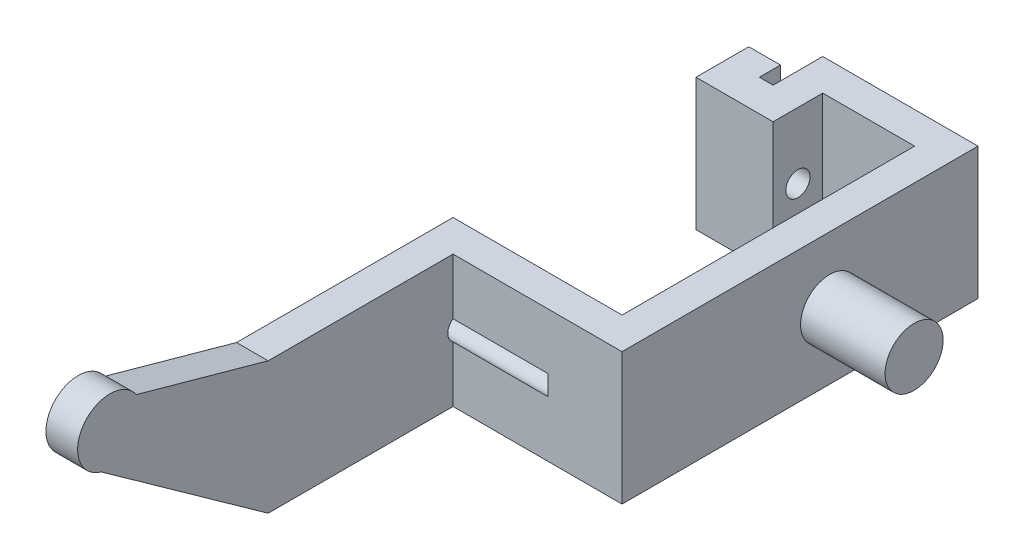
ISO-10303-21;
HEADER;
FILE_DESCRIPTION(('STEP AP214'),'2;1');
FILE_NAME('part.step','',(''),(''),'','','');
FILE_SCHEMA(('AUTOMOTIVE_DESIGN { 1 0 10303 214 1 1 1 1 }'));
ENDSEC;
DATA;
#1=APPLICATION_CONTEXT('core data for automotive mechanical design processes');
#2=APPLICATION_PROTOCOL_DEFINITION('international standard','automotive_design',2000,#1);
#3=PRODUCT_CONTEXT('',#1,'mechanical');
#4=PRODUCT('Part','Part','',(#3));
#5=PRODUCT_RELATED_PRODUCT_CATEGORY('part','',(#4));
#6=PRODUCT_DEFINITION_FORMATION('','',#4);
#7=PRODUCT_DEFINITION_CONTEXT('part definition',#1,'design');
#8=PRODUCT_DEFINITION('design','',#6,#7);
#9=PRODUCT_DEFINITION_SHAPE('','',#8);
#10=(LENGTH_UNIT() NAMED_UNIT(*) SI_UNIT(.MILLI.,.METRE.));
#11=(NAMED_UNIT(*) PLANE_ANGLE_UNIT() SI_UNIT($,.RADIAN.));
#12=(NAMED_UNIT(*) SI_UNIT($,.STERADIAN.) SOLID_ANGLE_UNIT());
#13=UNCERTAINTY_MEASURE_WITH_UNIT(LENGTH_MEASURE(1.E-05),#10,'distance_accuracy_value','');
#14=(GEOMETRIC_REPRESENTATION_CONTEXT(3) GLOBAL_UNCERTAINTY_ASSIGNED_CONTEXT((#13)) GLOBAL_UNIT_ASSIGNED_CONTEXT((#10,
#11,#12)) REPRESENTATION_CONTEXT('',''));
#15=CARTESIAN_POINT('',(0.,0.,0.));
#16=DIRECTION('',(0.,0.,1.));
#17=DIRECTION('',(1.,0.,0.));
#18=AXIS2_PLACEMENT_3D('',#15,#16,#17);
#19=CARTESIAN_POINT('',(0.,0.,0.));
#20=DIRECTION('',(0.,1.,0.));
#21=DIRECTION('',(0.,0.,1.));
#22=AXIS2_PLACEMENT_3D('',#19,#20,#21);
#23=PLANE('',#22);
#24=DIRECTION('',(1.,0.,0.));
#25=VECTOR('',#24,1.);
#26=CARTESIAN_POINT('',(0.,0.,43.5));
#27=LINE('',#26,#25);
#28=CARTESIAN_POINT('',(0.,0.,43.5));
#29=VERTEX_POINT('',#28);
#30=CARTESIAN_POINT('',(3.,0.,43.5));
#31=VERTEX_POINT('',#30);
#32=EDGE_CURVE('E207',#29,#31,#27,.T.);
#33=ORIENTED_EDGE('',*,*,#32,.F.);
#34=DIRECTION('',(0.,0.,1.));
#35=VECTOR('',#34,1.);
#36=CARTESIAN_POINT('',(0.,0.,0.));
#37=LINE('',#36,#35);
#38=CARTESIAN_POINT('',(0.,0.,23.));
#39=VERTEX_POINT('',#38);
#40=EDGE_CURVE('E214',#39,#29,#37,.T.);
#41=ORIENTED_EDGE('',*,*,#40,.F.);
#42=DIRECTION('',(-1.,0.,0.));
#43=VECTOR('',#42,1.);
#44=CARTESIAN_POINT('',(0.,0.,23.));
#45=LINE('',#44,#43);
#46=CARTESIAN_POINT('',(16.,0.,23.));
#47=VERTEX_POINT('',#46);
#48=EDGE_CURVE('E296',#47,#39,#45,.T.);
#49=ORIENTED_EDGE('',*,*,#48,.F.);
#50=DIRECTION('',(0.,0.,-1.));
#51=VECTOR('',#50,1.);
#52=CARTESIAN_POINT('',(16.,0.,0.));
#53=LINE('',#52,#51);
#54=CARTESIAN_POINT('',(16.,0.,-4.7));
#55=VERTEX_POINT('',#54);
#56=EDGE_CURVE('E248',#47,#55,#53,.T.);
#57=ORIENTED_EDGE('',*,*,#56,.T.);
#58=DIRECTION('',(-1.,0.,0.));
#59=VECTOR('',#58,1.);
#60=CARTESIAN_POINT('',(0.,0.,-4.7));
#61=LINE('',#60,#59);
#62=CARTESIAN_POINT('',(7.3,0.,-4.7));
#63=VERTEX_POINT('',#62);
#64=EDGE_CURVE('E253',#55,#63,#61,.T.);
#65=ORIENTED_EDGE('',*,*,#64,.T.);
#66=DIRECTION('',(0.,0.,1.));
#67=VECTOR('',#66,1.);
#68=CARTESIAN_POINT('',(7.3,0.,0.));
#69=LINE('',#68,#67);
#70=CARTESIAN_POINT('',(7.3,0.,0.));
#71=VERTEX_POINT('',#70);
#72=EDGE_CURVE('E329',#63,#71,#69,.T.);
#73=ORIENTED_EDGE('',*,*,#72,.T.);
#74=DIRECTION('',(1.,0.,0.));
#75=VECTOR('',#74,1.);
#76=CARTESIAN_POINT('',(0.,0.,0.));
#77=LINE('',#76,#75);
#78=CARTESIAN_POINT('',(0.,0.,0.));
#79=VERTEX_POINT('',#78);
#80=EDGE_CURVE('E326',#79,#71,#77,.T.);
#81=ORIENTED_EDGE('',*,*,#80,.F.);
#82=DIRECTION('',(0.,0.,-1.));
#83=VECTOR('',#82,1.);
#84=CARTESIAN_POINT('',(0.,0.,0.));
#85=LINE('',#84,#83);
#86=CARTESIAN_POINT('',(0.,0.,-5.));
#87=VERTEX_POINT('',#86);
#88=EDGE_CURVE('E323',#79,#87,#85,.T.);
#89=ORIENTED_EDGE('',*,*,#88,.T.);
#90=DIRECTION('',(1.,0.,0.));
#91=VECTOR('',#90,1.);
#92=CARTESIAN_POINT('',(0.,0.,-5.));
#93=LINE('',#92,#91);
#94=CARTESIAN_POINT('',(3.,0.,-5.));
#95=VERTEX_POINT('',#94);
#96=EDGE_CURVE('E320',#87,#95,#93,.T.);
#97=ORIENTED_EDGE('',*,*,#96,.T.);
#98=DIRECTION('',(0.,0.,1.));
#99=VECTOR('',#98,1.);
#100=CARTESIAN_POINT('',(3.,0.,0.));
#101=LINE('',#100,#99);
#102=CARTESIAN_POINT('',(3.,0.,-3.));
#103=VERTEX_POINT('',#102);
#104=EDGE_CURVE('E317',#95,#103,#101,.T.);
#105=ORIENTED_EDGE('',*,*,#104,.T.);
#106=DIRECTION('',(1.,0.,0.));
#107=VECTOR('',#106,1.);
#108=CARTESIAN_POINT('',(0.,0.,-3.));
#109=LINE('',#108,#107);
#110=CARTESIAN_POINT('',(4.3,0.,-3.));
#111=VERTEX_POINT('',#110);
#112=EDGE_CURVE('E314',#103,#111,#109,.T.);
#113=ORIENTED_EDGE('',*,*,#112,.T.);
#114=DIRECTION('',(0.,0.,-1.));
#115=VECTOR('',#114,1.);
#116=CARTESIAN_POINT('',(4.3,0.,0.));
#117=LINE('',#116,#115);
#118=CARTESIAN_POINT('',(4.3,0.,-7.7));
#119=VERTEX_POINT('',#118);
#120=EDGE_CURVE('E311',#111,#119,#117,.T.);
#121=ORIENTED_EDGE('',*,*,#120,.T.);
#122=DIRECTION('',(1.,0.,0.));
#123=VECTOR('',#122,1.);
#124=CARTESIAN_POINT('',(0.,0.,-7.7));
#125=LINE('',#124,#123);
#126=CARTESIAN_POINT('',(19.,0.,-7.7));
#127=VERTEX_POINT('',#126);
#128=EDGE_CURVE('E308',#119,#127,#125,.T.);
#129=ORIENTED_EDGE('',*,*,#128,.T.);
#130=DIRECTION('',(0.,0.,1.));
#131=VECTOR('',#130,1.);
#132=CARTESIAN_POINT('',(19.,0.,0.));
#133=LINE('',#132,#131);
#134=CARTESIAN_POINT('',(19.,0.,26.));
#135=VERTEX_POINT('',#134);
#136=EDGE_CURVE('E305',#127,#135,#133,.T.);
#137=ORIENTED_EDGE('',*,*,#136,.T.);
#138=DIRECTION('',(-1.,0.,0.));
#139=VECTOR('',#138,1.);
#140=CARTESIAN_POINT('',(0.,0.,26.));
#141=LINE('',#140,#139);
#142=CARTESIAN_POINT('',(3.,0.,26.));
#143=VERTEX_POINT('',#142);
#144=EDGE_CURVE('E302',#135,#143,#141,.T.);
#145=ORIENTED_EDGE('',*,*,#144,.T.);
#146=DIRECTION('',(0.,0.,1.));
#147=VECTOR('',#146,1.);
#148=CARTESIAN_POINT('',(2.99999999999999,0.,0.));
#149=LINE('',#148,#147);
#150=EDGE_CURVE('E299',#143,#31,#149,.T.);
#151=ORIENTED_EDGE('',*,*,#150,.T.);
#152=EDGE_LOOP('',(#33,#41,#49,#57,#65,#73,#81,#89,#97,#105,#113,#121,#129,#137,#145,#151));
#153=FACE_BOUND('',#152,.T.);
#154=ADVANCED_FACE('F37',(#153),#23,.F.);
#155=CARTESIAN_POINT('',(0.,12.5,-3.));
#156=DIRECTION('',(0.,0.,-1.));
#157=DIRECTION('',(-1.,0.,0.));
#158=AXIS2_PLACEMENT_3D('',#155,#156,#157);
#159=PLANE('',#158);
#160=DIRECTION('',(-1.,0.,0.));
#161=VECTOR('',#160,1.);
#162=CARTESIAN_POINT('',(12.,5.30131670194949,-3.));
#163=LINE('',#162,#161);
#164=CARTESIAN_POINT('',(4.3,5.30131670194949,-3.));
#165=VERTEX_POINT('',#164);
#166=CARTESIAN_POINT('',(3.,5.30131670194949,-3.));
#167=VERTEX_POINT('',#166);
#168=EDGE_CURVE('E60',#165,#167,#163,.T.);
#169=ORIENTED_EDGE('',*,*,#168,.F.);
#170=DIRECTION('',(0.,-1.,0.));
#171=VECTOR('',#170,1.);
#172=CARTESIAN_POINT('',(4.3,12.5,-3.));
#173=LINE('',#172,#171);
#174=EDGE_CURVE('E349',#165,#111,#173,.T.);
#175=ORIENTED_EDGE('',*,*,#174,.T.);
#176=ORIENTED_EDGE('',*,*,#112,.F.);
#177=DIRECTION('',(0.,-1.,0.));
#178=VECTOR('',#177,1.);
#179=CARTESIAN_POINT('',(3.,12.5,-3.));
#180=LINE('',#179,#178);
#181=EDGE_CURVE('E345',#167,#103,#180,.T.);
#182=ORIENTED_EDGE('',*,*,#181,.F.);
#183=EDGE_LOOP('',(#169,#175,#176,#182));
#184=FACE_BOUND('',#183,.T.);
#185=ADVANCED_FACE('F458',(#184),#159,.T.);
#186=CARTESIAN_POINT('',(16.,12.5,0.));
#187=DIRECTION('',(-1.,0.,0.));
#188=DIRECTION('',(0.,0.,1.));
#189=AXIS2_PLACEMENT_3D('',#186,#187,#188);
#190=PLANE('',#189);
#191=ORIENTED_EDGE('',*,*,#56,.F.);
#192=DIRECTION('',(0.,-1.,0.));
#193=VECTOR('',#192,1.);
#194=CARTESIAN_POINT('',(16.,12.5,23.));
#195=LINE('',#194,#193);
#196=CARTESIAN_POINT('',(16.,12.5,23.));
#197=VERTEX_POINT('',#196);
#198=EDGE_CURVE('E365',#197,#47,#195,.T.);
#199=ORIENTED_EDGE('',*,*,#198,.F.);
#200=DIRECTION('',(0.,0.,-1.));
#201=VECTOR('',#200,1.);
#202=CARTESIAN_POINT('',(16.,12.5,0.));
#203=LINE('',#202,#201);
#204=CARTESIAN_POINT('',(16.,12.5,-4.7));
#205=VERTEX_POINT('',#204);
#206=EDGE_CURVE('E249',#197,#205,#203,.T.);
#207=ORIENTED_EDGE('',*,*,#206,.T.);
#208=DIRECTION('',(0.,-1.,0.));
#209=VECTOR('',#208,1.);
#210=CARTESIAN_POINT('',(16.,12.5,-4.7));
#211=LINE('',#210,#209);
#212=EDGE_CURVE('E293',#205,#55,#211,.T.);
#213=ORIENTED_EDGE('',*,*,#212,.T.);
#214=EDGE_LOOP('',(#191,#199,#207,#213));
#215=FACE_BOUND('',#214,.T.);
#216=ADVANCED_FACE('F39',(#215),#190,.T.);
#217=CARTESIAN_POINT('',(0.,12.5,23.));
#218=DIRECTION('',(0.,0.,1.));
#219=DIRECTION('',(1.,0.,0.));
#220=AXIS2_PLACEMENT_3D('',#217,#218,#219);
#221=PLANE('',#220);
#222=ORIENTED_EDGE('',*,*,#48,.T.);
#223=DIRECTION('',(0.,-1.,0.));
#224=VECTOR('',#223,1.);
#225=CARTESIAN_POINT('',(0.,12.5,23.));
#226=LINE('',#225,#224);
#227=CARTESIAN_POINT('',(0.,12.5,23.));
#228=VERTEX_POINT('',#227);
#229=EDGE_CURVE('E363',#228,#39,#226,.T.);
#230=ORIENTED_EDGE('',*,*,#229,.F.);
#231=DIRECTION('',(-1.,0.,0.));
#232=VECTOR('',#231,1.);
#233=CARTESIAN_POINT('',(0.,12.5,23.));
#234=LINE('',#233,#232);
#235=EDGE_CURVE('E252',#197,#228,#234,.T.);
#236=ORIENTED_EDGE('',*,*,#235,.F.);
#237=ORIENTED_EDGE('',*,*,#198,.T.);
#238=EDGE_LOOP('',(#222,#230,#236,#237));
#239=FACE_BOUND('',#238,.T.);
#240=ADVANCED_FACE('F438',(#239),#221,.F.);
#241=CARTESIAN_POINT('',(0.,12.5,0.));
#242=DIRECTION('',(1.,0.,0.));
#243=DIRECTION('',(0.,0.,-1.));
#244=AXIS2_PLACEMENT_3D('',#241,#242,#243);
#245=PLANE('',#244);
#246=DIRECTION('',(0.,-0.581238193719096,-0.813733471206735));
#247=VECTOR('',#246,1.);
#248=CARTESIAN_POINT('',(0.,-20.5743243243243,14.695945945946));
#249=LINE('',#248,#247);
#250=CARTESIAN_POINT('',(0.,11.2947321170914,59.3126249639279));
#251=VERTEX_POINT('',#250);
#252=EDGE_CURVE('E203',#251,#29,#249,.T.);
#253=ORIENTED_EDGE('',*,*,#252,.F.);
#254=CARTESIAN_POINT('',(0.,14.234142689408,58.4871863170623));
#255=DIRECTION('',(1.,0.,0.));
#256=DIRECTION('',(0.,0.,-1.));
#257=AXIS2_PLACEMENT_3D('',#254,#255,#256);
#258=CIRCLE('',#257,3.05311045859563);
#259=CARTESIAN_POINT('',(0.,15.968285378816,55.9743726341246));
#260=VERTEX_POINT('',#259);
#261=EDGE_CURVE('E187',#251,#260,#258,.F.);
#262=ORIENTED_EDGE('',*,*,#261,.T.);
#263=DIRECTION('',(0.,0.26787200310575,0.963454508501628));
#264=VECTOR('',#263,1.);
#265=CARTESIAN_POINT('',(0.,0.376469098829962,-0.104670776586882));
#266=LINE('',#265,#264);
#267=CARTESIAN_POINT('',(0.,12.5,43.5));
#268=VERTEX_POINT('',#267);
#269=EDGE_CURVE('E198',#268,#260,#266,.T.);
#270=ORIENTED_EDGE('',*,*,#269,.F.);
#271=DIRECTION('',(0.,0.,1.));
#272=VECTOR('',#271,1.);
#273=CARTESIAN_POINT('',(0.,12.5,0.));
#274=LINE('',#273,#272);
#275=EDGE_CURVE('E255',#228,#268,#274,.T.);
#276=ORIENTED_EDGE('',*,*,#275,.F.);
#277=ORIENTED_EDGE('',*,*,#229,.T.);
#278=ORIENTED_EDGE('',*,*,#40,.T.);
#279=EDGE_LOOP('',(#253,#262,#270,#276,#277,#278));
#280=FACE_BOUND('',#279,.T.);
#281=CARTESIAN_POINT('',(0.,6.25,25.35));
#282=DIRECTION('',(-1.,0.,0.));
#283=DIRECTION('',(0.,0.,1.));
#284=AXIS2_PLACEMENT_3D('',#281,#282,#283);
#285=CIRCLE('',#284,1.15);
#286=CARTESIAN_POINT('',(0.,6.25,26.5));
#287=VERTEX_POINT('',#286);
#288=EDGE_CURVE('E230',#287,#287,#285,.T.);
#289=ORIENTED_EDGE('',*,*,#288,.F.);
#290=EDGE_LOOP('',(#289));
#291=FACE_BOUND('',#290,.T.);
#292=ADVANCED_FACE('F210',(#280,#291),#245,.F.);
#293=CARTESIAN_POINT('',(2.99999999999999,12.5,0.));
#294=DIRECTION('',(1.,0.,0.));
#295=DIRECTION('',(0.,0.,-1.));
#296=AXIS2_PLACEMENT_3D('',#293,#294,#295);
#297=PLANE('',#296);
#298=CARTESIAN_POINT('',(3.,14.234142689408,58.4871863170623));
#299=DIRECTION('',(1.,0.,0.));
#300=DIRECTION('',(0.,0.,-1.));
#301=AXIS2_PLACEMENT_3D('',#298,#299,#300);
#302=CIRCLE('',#301,3.05311045859563);
#303=CARTESIAN_POINT('',(3.,11.2947321170914,59.3126249639279));
#304=VERTEX_POINT('',#303);
#305=CARTESIAN_POINT('',(3.,15.968285378816,55.9743726341246));
#306=VERTEX_POINT('',#305);
#307=EDGE_CURVE('E218',#304,#306,#302,.F.);
#308=ORIENTED_EDGE('',*,*,#307,.F.);
#309=DIRECTION('',(0.,-0.581238193719096,-0.813733471206735));
#310=VECTOR('',#309,1.);
#311=CARTESIAN_POINT('',(3.,-20.5743243243243,14.695945945946));
#312=LINE('',#311,#310);
#313=EDGE_CURVE('E206',#304,#31,#312,.T.);
#314=ORIENTED_EDGE('',*,*,#313,.T.);
#315=ORIENTED_EDGE('',*,*,#150,.F.);
#316=DIRECTION('',(0.,-1.,0.));
#317=VECTOR('',#316,1.);
#318=CARTESIAN_POINT('',(3.,12.5,26.));
#319=LINE('',#318,#317);
#320=CARTESIAN_POINT('',(3.,5.30131670194948,26.));
#321=VERTEX_POINT('',#320);
#322=EDGE_CURVE('E359',#321,#143,#319,.T.);
#323=ORIENTED_EDGE('',*,*,#322,.F.);
#324=CARTESIAN_POINT('',(3.,6.25,25.35));
#325=DIRECTION('',(1.,0.,0.));
#326=DIRECTION('',(0.,0.,-1.));
#327=AXIS2_PLACEMENT_3D('',#324,#325,#326);
#328=CIRCLE('',#327,1.15);
#329=CARTESIAN_POINT('',(3.,7.19868329805052,26.));
#330=VERTEX_POINT('',#329);
#331=EDGE_CURVE('E246',#330,#321,#328,.T.);
#332=ORIENTED_EDGE('',*,*,#331,.F.);
#333=CARTESIAN_POINT('',(3.,12.5,26.));
#334=VERTEX_POINT('',#333);
#335=EDGE_CURVE('E360',#334,#330,#319,.T.);
#336=ORIENTED_EDGE('',*,*,#335,.F.);
#337=DIRECTION('',(0.,0.,1.));
#338=VECTOR('',#337,1.);
#339=CARTESIAN_POINT('',(2.99999999999999,12.5,0.));
#340=LINE('',#339,#338);
#341=CARTESIAN_POINT('',(3.,12.5,43.5));
#342=VERTEX_POINT('',#341);
#343=EDGE_CURVE('E258',#334,#342,#340,.T.);
#344=ORIENTED_EDGE('',*,*,#343,.T.);
#345=DIRECTION('',(0.,0.26787200310575,0.963454508501628));
#346=VECTOR('',#345,1.);
#347=CARTESIAN_POINT('',(2.99999999999999,0.376469098829962,-0.104670776586883));
#348=LINE('',#347,#346);
#349=EDGE_CURVE('E199',#342,#306,#348,.T.);
#350=ORIENTED_EDGE('',*,*,#349,.T.);
#351=EDGE_LOOP('',(#308,#314,#315,#323,#332,#336,#344,#350));
#352=FACE_BOUND('',#351,.T.);
#353=ADVANCED_FACE('F381',(#352),#297,.T.);
#354=CARTESIAN_POINT('',(0.,12.5,26.));
#355=DIRECTION('',(0.,0.,1.));
#356=DIRECTION('',(1.,0.,0.));
#357=AXIS2_PLACEMENT_3D('',#354,#355,#356);
#358=PLANE('',#357);
#359=DIRECTION('',(-1.,0.,0.));
#360=VECTOR('',#359,1.);
#361=CARTESIAN_POINT('',(12.,7.19868329805052,26.));
#362=LINE('',#361,#360);
#363=CARTESIAN_POINT('',(12.,7.19868329805052,26.));
#364=VERTEX_POINT('',#363);
#365=EDGE_CURVE('E41',#364,#330,#362,.T.);
#366=ORIENTED_EDGE('',*,*,#365,.F.);
#367=DIRECTION('',(0.,-1.,0.));
#368=VECTOR('',#367,1.);
#369=CARTESIAN_POINT('',(12.,12.5,26.));
#370=LINE('',#369,#368);
#371=CARTESIAN_POINT('',(12.,5.30131670194948,26.));
#372=VERTEX_POINT('',#371);
#373=EDGE_CURVE('E367',#364,#372,#370,.T.);
#374=ORIENTED_EDGE('',*,*,#373,.T.);
#375=DIRECTION('',(-1.,0.,0.));
#376=VECTOR('',#375,1.);
#377=CARTESIAN_POINT('',(12.,5.30131670194948,26.));
#378=LINE('',#377,#376);
#379=EDGE_CURVE('E371',#321,#372,#378,.F.);
#380=ORIENTED_EDGE('',*,*,#379,.F.);
#381=ORIENTED_EDGE('',*,*,#322,.T.);
#382=ORIENTED_EDGE('',*,*,#144,.F.);
#383=DIRECTION('',(0.,-1.,0.));
#384=VECTOR('',#383,1.);
#385=CARTESIAN_POINT('',(19.,12.5,26.));
#386=LINE('',#385,#384);
#387=CARTESIAN_POINT('',(19.,12.5,26.));
#388=VERTEX_POINT('',#387);
#389=EDGE_CURVE('E357',#388,#135,#386,.T.);
#390=ORIENTED_EDGE('',*,*,#389,.F.);
#391=DIRECTION('',(-1.,0.,0.));
#392=VECTOR('',#391,1.);
#393=CARTESIAN_POINT('',(0.,12.5,26.));
#394=LINE('',#393,#392);
#395=EDGE_CURVE('E261',#388,#334,#394,.T.);
#396=ORIENTED_EDGE('',*,*,#395,.T.);
#397=ORIENTED_EDGE('',*,*,#335,.T.);
#398=EDGE_LOOP('',(#366,#374,#380,#381,#382,#390,#396,#397));
#399=FACE_BOUND('',#398,.T.);
#400=ADVANCED_FACE('F384',(#399),#358,.T.);
#401=CARTESIAN_POINT('',(19.,12.5,0.));
#402=DIRECTION('',(1.,0.,0.));
#403=DIRECTION('',(0.,0.,-1.));
#404=AXIS2_PLACEMENT_3D('',#401,#402,#403);
#405=PLANE('',#404);
#406=CARTESIAN_POINT('',(19.,6.25,6.35));
#407=DIRECTION('',(1.,0.,0.));
#408=DIRECTION('',(0.,0.,-1.));
#409=AXIS2_PLACEMENT_3D('',#406,#407,#408);
#410=CIRCLE('',#409,2.75);
#411=CARTESIAN_POINT('',(19.,6.25,3.6));
#412=VERTEX_POINT('',#411);
#413=EDGE_CURVE('E11',#412,#412,#410,.T.);
#414=ORIENTED_EDGE('',*,*,#413,.F.);
#415=EDGE_LOOP('',(#414));
#416=FACE_BOUND('',#415,.T.);
#417=ORIENTED_EDGE('',*,*,#136,.F.);
#418=DIRECTION('',(0.,-1.,0.));
#419=VECTOR('',#418,1.);
#420=CARTESIAN_POINT('',(19.,12.5,-7.7));
#421=LINE('',#420,#419);
#422=CARTESIAN_POINT('',(19.,12.5,-7.7));
#423=VERTEX_POINT('',#422);
#424=EDGE_CURVE('E355',#423,#127,#421,.T.);
#425=ORIENTED_EDGE('',*,*,#424,.F.);
#426=DIRECTION('',(0.,0.,1.));
#427=VECTOR('',#426,1.);
#428=CARTESIAN_POINT('',(19.,12.5,0.));
#429=LINE('',#428,#427);
#430=EDGE_CURVE('E264',#423,#388,#429,.T.);
#431=ORIENTED_EDGE('',*,*,#430,.T.);
#432=ORIENTED_EDGE('',*,*,#389,.T.);
#433=EDGE_LOOP('',(#417,#425,#431,#432));
#434=FACE_BOUND('',#433,.T.);
#435=ADVANCED_FACE('F393',(#416,#434),#405,.T.);
#436=CARTESIAN_POINT('',(0.,12.5,-7.7));
#437=DIRECTION('',(0.,0.,-1.));
#438=DIRECTION('',(-1.,0.,0.));
#439=AXIS2_PLACEMENT_3D('',#436,#437,#438);
#440=PLANE('',#439);
#441=ORIENTED_EDGE('',*,*,#128,.F.);
#442=DIRECTION('',(0.,-1.,0.));
#443=VECTOR('',#442,1.);
#444=CARTESIAN_POINT('',(4.3,12.5,-7.7));
#445=LINE('',#444,#443);
#446=CARTESIAN_POINT('',(4.3,12.5,-7.7));
#447=VERTEX_POINT('',#446);
#448=EDGE_CURVE('E353',#447,#119,#445,.T.);
#449=ORIENTED_EDGE('',*,*,#448,.F.);
#450=DIRECTION('',(1.,0.,0.));
#451=VECTOR('',#450,1.);
#452=CARTESIAN_POINT('',(0.,12.5,-7.7));
#453=LINE('',#452,#451);
#454=EDGE_CURVE('E267',#447,#423,#453,.T.);
#455=ORIENTED_EDGE('',*,*,#454,.T.);
#456=ORIENTED_EDGE('',*,*,#424,.T.);
#457=EDGE_LOOP('',(#441,#449,#455,#456));
#458=FACE_BOUND('',#457,.T.);
#459=ADVANCED_FACE('F396',(#458),#440,.T.);
#460=CARTESIAN_POINT('',(4.3,12.5,0.));
#461=DIRECTION('',(-1.,0.,0.));
#462=DIRECTION('',(0.,0.,1.));
#463=AXIS2_PLACEMENT_3D('',#460,#461,#462);
#464=PLANE('',#463);
#465=CARTESIAN_POINT('',(4.3,6.25,-2.35));
#466=DIRECTION('',(-1.,0.,0.));
#467=DIRECTION('',(0.,0.,1.));
#468=AXIS2_PLACEMENT_3D('',#465,#466,#467);
#469=CIRCLE('',#468,1.15);
#470=CARTESIAN_POINT('',(4.3,7.19868329805051,-3.));
#471=VERTEX_POINT('',#470);
#472=EDGE_CURVE('E244',#471,#165,#469,.T.);
#473=ORIENTED_EDGE('',*,*,#472,.F.);
#474=CARTESIAN_POINT('',(4.3,12.5,-3.));
#475=VERTEX_POINT('',#474);
#476=EDGE_CURVE('E350',#475,#471,#173,.T.);
#477=ORIENTED_EDGE('',*,*,#476,.F.);
#478=DIRECTION('',(0.,0.,-1.));
#479=VECTOR('',#478,1.);
#480=CARTESIAN_POINT('',(4.3,12.5,0.));
#481=LINE('',#480,#479);
#482=EDGE_CURVE('E270',#475,#447,#481,.T.);
#483=ORIENTED_EDGE('',*,*,#482,.T.);
#484=ORIENTED_EDGE('',*,*,#448,.T.);
#485=ORIENTED_EDGE('',*,*,#120,.F.);
#486=ORIENTED_EDGE('',*,*,#174,.F.);
#487=EDGE_LOOP('',(#473,#477,#483,#484,#485,#486));
#488=FACE_BOUND('',#487,.T.);
#489=ADVANCED_FACE('F401',(#488),#464,.T.);
#490=DIRECTION('',(-1.,0.,0.));
#491=VECTOR('',#490,1.);
#492=CARTESIAN_POINT('',(12.,7.19868329805051,-3.));
#493=LINE('',#492,#491);
#494=CARTESIAN_POINT('',(3.,7.19868329805051,-3.));
#495=VERTEX_POINT('',#494);
#496=EDGE_CURVE('E241',#495,#471,#493,.F.);
#497=ORIENTED_EDGE('',*,*,#496,.F.);
#498=CARTESIAN_POINT('',(3.,12.5,-3.));
#499=VERTEX_POINT('',#498);
#500=EDGE_CURVE('E346',#499,#495,#180,.T.);
#501=ORIENTED_EDGE('',*,*,#500,.F.);
#502=DIRECTION('',(1.,0.,0.));
#503=VECTOR('',#502,1.);
#504=CARTESIAN_POINT('',(0.,12.5,-3.));
#505=LINE('',#504,#503);
#506=EDGE_CURVE('E273',#499,#475,#505,.T.);
#507=ORIENTED_EDGE('',*,*,#506,.T.);
#508=ORIENTED_EDGE('',*,*,#476,.T.);
#509=EDGE_LOOP('',(#497,#501,#507,#508));
#510=FACE_BOUND('',#509,.T.);
#511=ADVANCED_FACE('F406',(#510),#159,.T.);
#512=CARTESIAN_POINT('',(3.,12.5,0.));
#513=DIRECTION('',(1.,0.,0.));
#514=DIRECTION('',(0.,0.,-1.));
#515=AXIS2_PLACEMENT_3D('',#512,#513,#514);
#516=PLANE('',#515);
#517=CARTESIAN_POINT('',(3.,6.25,-2.35));
#518=DIRECTION('',(1.,0.,0.));
#519=DIRECTION('',(0.,0.,-1.));
#520=AXIS2_PLACEMENT_3D('',#517,#518,#519);
#521=CIRCLE('',#520,1.15);
#522=EDGE_CURVE('E239',#167,#495,#521,.T.);
#523=ORIENTED_EDGE('',*,*,#522,.F.);
#524=ORIENTED_EDGE('',*,*,#181,.T.);
#525=ORIENTED_EDGE('',*,*,#104,.F.);
#526=DIRECTION('',(0.,-1.,0.));
#527=VECTOR('',#526,1.);
#528=CARTESIAN_POINT('',(3.,12.5,-5.));
#529=LINE('',#528,#527);
#530=CARTESIAN_POINT('',(3.,12.5,-5.));
#531=VERTEX_POINT('',#530);
#532=EDGE_CURVE('E343',#531,#95,#529,.T.);
#533=ORIENTED_EDGE('',*,*,#532,.F.);
#534=DIRECTION('',(0.,0.,1.));
#535=VECTOR('',#534,1.);
#536=CARTESIAN_POINT('',(3.,12.5,0.));
#537=LINE('',#536,#535);
#538=EDGE_CURVE('E276',#531,#499,#537,.T.);
#539=ORIENTED_EDGE('',*,*,#538,.T.);
#540=ORIENTED_EDGE('',*,*,#500,.T.);
#541=EDGE_LOOP('',(#523,#524,#525,#533,#539,#540));
#542=FACE_BOUND('',#541,.T.);
#543=ADVANCED_FACE('F410',(#542),#516,.T.);
#544=CARTESIAN_POINT('',(0.,12.5,-5.));
#545=DIRECTION('',(0.,0.,-1.));
#546=DIRECTION('',(-1.,0.,0.));
#547=AXIS2_PLACEMENT_3D('',#544,#545,#546);
#548=PLANE('',#547);
#549=ORIENTED_EDGE('',*,*,#96,.F.);
#550=DIRECTION('',(0.,-1.,0.));
#551=VECTOR('',#550,1.);
#552=CARTESIAN_POINT('',(0.,12.5,-5.));
#553=LINE('',#552,#551);
#554=CARTESIAN_POINT('',(0.,12.5,-5.));
#555=VERTEX_POINT('',#554);
#556=EDGE_CURVE('E341',#555,#87,#553,.T.);
#557=ORIENTED_EDGE('',*,*,#556,.F.);
#558=DIRECTION('',(1.,0.,0.));
#559=VECTOR('',#558,1.);
#560=CARTESIAN_POINT('',(0.,12.5,-5.));
#561=LINE('',#560,#559);
#562=EDGE_CURVE('E279',#555,#531,#561,.T.);
#563=ORIENTED_EDGE('',*,*,#562,.T.);
#564=ORIENTED_EDGE('',*,*,#532,.T.);
#565=EDGE_LOOP('',(#549,#557,#563,#564));
#566=FACE_BOUND('',#565,.T.);
#567=ADVANCED_FACE('F414',(#566),#548,.T.);
#568=CARTESIAN_POINT('',(0.,12.5,0.));
#569=DIRECTION('',(-1.,0.,0.));
#570=DIRECTION('',(0.,0.,1.));
#571=AXIS2_PLACEMENT_3D('',#568,#569,#570);
#572=PLANE('',#571);
#573=CARTESIAN_POINT('',(0.,6.25,-2.35));
#574=DIRECTION('',(-1.,0.,0.));
#575=DIRECTION('',(0.,0.,1.));
#576=AXIS2_PLACEMENT_3D('',#573,#574,#575);
#577=CIRCLE('',#576,1.15);
#578=CARTESIAN_POINT('',(0.,6.25,-1.2));
#579=VERTEX_POINT('',#578);
#580=EDGE_CURVE('E232',#579,#579,#577,.T.);
#581=ORIENTED_EDGE('',*,*,#580,.F.);
#582=EDGE_LOOP('',(#581));
#583=FACE_BOUND('',#582,.T.);
#584=ORIENTED_EDGE('',*,*,#88,.F.);
#585=DIRECTION('',(0.,-1.,0.));
#586=VECTOR('',#585,1.);
#587=CARTESIAN_POINT('',(0.,12.5,0.));
#588=LINE('',#587,#586);
#589=CARTESIAN_POINT('',(0.,12.5,0.));
#590=VERTEX_POINT('',#589);
#591=EDGE_CURVE('E339',#590,#79,#588,.T.);
#592=ORIENTED_EDGE('',*,*,#591,.F.);
#593=DIRECTION('',(0.,0.,-1.));
#594=VECTOR('',#593,1.);
#595=CARTESIAN_POINT('',(0.,12.5,0.));
#596=LINE('',#595,#594);
#597=EDGE_CURVE('E282',#590,#555,#596,.T.);
#598=ORIENTED_EDGE('',*,*,#597,.T.);
#599=ORIENTED_EDGE('',*,*,#556,.T.);
#600=EDGE_LOOP('',(#584,#592,#598,#599));
#601=FACE_BOUND('',#600,.T.);
#602=ADVANCED_FACE('F418',(#583,#601),#572,.T.);
#603=CARTESIAN_POINT('',(0.,12.5,0.));
#604=DIRECTION('',(0.,0.,-1.));
#605=DIRECTION('',(-1.,0.,0.));
#606=AXIS2_PLACEMENT_3D('',#603,#604,#605);
#607=PLANE('',#606);
#608=ORIENTED_EDGE('',*,*,#80,.T.);
#609=DIRECTION('',(0.,-1.,0.));
#610=VECTOR('',#609,1.);
#611=CARTESIAN_POINT('',(7.3,12.5,0.));
#612=LINE('',#611,#610);
#613=CARTESIAN_POINT('',(7.3,12.5,0.));
#614=VERTEX_POINT('',#613);
#615=EDGE_CURVE('E337',#614,#71,#612,.T.);
#616=ORIENTED_EDGE('',*,*,#615,.F.);
#617=DIRECTION('',(1.,0.,0.));
#618=VECTOR('',#617,1.);
#619=CARTESIAN_POINT('',(0.,12.5,0.));
#620=LINE('',#619,#618);
#621=EDGE_CURVE('E285',#590,#614,#620,.T.);
#622=ORIENTED_EDGE('',*,*,#621,.F.);
#623=ORIENTED_EDGE('',*,*,#591,.T.);
#624=EDGE_LOOP('',(#608,#616,#622,#623));
#625=FACE_BOUND('',#624,.T.);
#626=ADVANCED_FACE('F423',(#625),#607,.F.);
#627=CARTESIAN_POINT('',(7.3,12.5,0.));
#628=DIRECTION('',(1.,0.,0.));
#629=DIRECTION('',(0.,0.,-1.));
#630=AXIS2_PLACEMENT_3D('',#627,#628,#629);
#631=PLANE('',#630);
#632=CARTESIAN_POINT('',(7.3,6.25,-2.35));
#633=DIRECTION('',(1.,0.,0.));
#634=DIRECTION('',(0.,0.,-1.));
#635=AXIS2_PLACEMENT_3D('',#632,#633,#634);
#636=CIRCLE('',#635,1.15);
#637=CARTESIAN_POINT('',(7.3,6.25,-3.5));
#638=VERTEX_POINT('',#637);
#639=EDGE_CURVE('E235',#638,#638,#636,.T.);
#640=ORIENTED_EDGE('',*,*,#639,.F.);
#641=EDGE_LOOP('',(#640));
#642=FACE_BOUND('',#641,.T.);
#643=ORIENTED_EDGE('',*,*,#72,.F.);
#644=DIRECTION('',(0.,-1.,0.));
#645=VECTOR('',#644,1.);
#646=CARTESIAN_POINT('',(7.3,12.5,-4.7));
#647=LINE('',#646,#645);
#648=CARTESIAN_POINT('',(7.3,12.5,-4.7));
#649=VERTEX_POINT('',#648);
#650=EDGE_CURVE('E335',#649,#63,#647,.T.);
#651=ORIENTED_EDGE('',*,*,#650,.F.);
#652=DIRECTION('',(0.,0.,1.));
#653=VECTOR('',#652,1.);
#654=CARTESIAN_POINT('',(7.3,12.5,0.));
#655=LINE('',#654,#653);
#656=EDGE_CURVE('E287',#649,#614,#655,.T.);
#657=ORIENTED_EDGE('',*,*,#656,.T.);
#658=ORIENTED_EDGE('',*,*,#615,.T.);
#659=EDGE_LOOP('',(#643,#651,#657,#658));
#660=FACE_BOUND('',#659,.T.);
#661=ADVANCED_FACE('F469',(#642,#660),#631,.T.);
#662=CARTESIAN_POINT('',(0.,12.5,-4.7));
#663=DIRECTION('',(0.,0.,1.));
#664=DIRECTION('',(1.,0.,0.));
#665=AXIS2_PLACEMENT_3D('',#662,#663,#664);
#666=PLANE('',#665);
#667=ORIENTED_EDGE('',*,*,#64,.F.);
#668=ORIENTED_EDGE('',*,*,#212,.F.);
#669=DIRECTION('',(-1.,0.,0.));
#670=VECTOR('',#669,1.);
#671=CARTESIAN_POINT('',(0.,12.5,-4.7));
#672=LINE('',#671,#670);
#673=EDGE_CURVE('E290',#205,#649,#672,.T.);
#674=ORIENTED_EDGE('',*,*,#673,.T.);
#675=ORIENTED_EDGE('',*,*,#650,.T.);
#676=EDGE_LOOP('',(#667,#668,#674,#675));
#677=FACE_BOUND('',#676,.T.);
#678=ADVANCED_FACE('F430',(#677),#666,.T.);
#679=CARTESIAN_POINT('',(0.,12.5,0.));
#680=DIRECTION('',(0.,1.,0.));
#681=DIRECTION('',(0.,0.,1.));
#682=AXIS2_PLACEMENT_3D('',#679,#680,#681);
#683=PLANE('',#682);
#684=DIRECTION('',(1.,0.,0.));
#685=VECTOR('',#684,1.);
#686=CARTESIAN_POINT('',(0.,12.5,43.5));
#687=LINE('',#686,#685);
#688=EDGE_CURVE('E221',#268,#342,#687,.T.);
#689=ORIENTED_EDGE('',*,*,#688,.T.);
#690=ORIENTED_EDGE('',*,*,#343,.F.);
#691=ORIENTED_EDGE('',*,*,#395,.F.);
#692=ORIENTED_EDGE('',*,*,#430,.F.);
#693=ORIENTED_EDGE('',*,*,#454,.F.);
#694=ORIENTED_EDGE('',*,*,#482,.F.);
#695=ORIENTED_EDGE('',*,*,#506,.F.);
#696=ORIENTED_EDGE('',*,*,#538,.F.);
#697=ORIENTED_EDGE('',*,*,#562,.F.);
#698=ORIENTED_EDGE('',*,*,#597,.F.);
#699=ORIENTED_EDGE('',*,*,#621,.T.);
#700=ORIENTED_EDGE('',*,*,#656,.F.);
#701=ORIENTED_EDGE('',*,*,#673,.F.);
#702=ORIENTED_EDGE('',*,*,#206,.F.);
#703=ORIENTED_EDGE('',*,*,#235,.T.);
#704=ORIENTED_EDGE('',*,*,#275,.T.);
#705=EDGE_LOOP('',(#689,#690,#691,#692,#693,#694,#695,#696,#697,#698,#699,#700,#701,#702,#703,#704));
#706=FACE_BOUND('',#705,.T.);
#707=ADVANCED_FACE('F389',(#706),#683,.T.);
#708=CARTESIAN_POINT('',(12.,6.25,-2.35));
#709=DIRECTION('',(-1.,0.,0.));
#710=DIRECTION('',(0.,0.,1.));
#711=AXIS2_PLACEMENT_3D('',#708,#709,#710);
#712=CYLINDRICAL_SURFACE('',#711,1.15);
#713=ORIENTED_EDGE('',*,*,#472,.T.);
#714=ORIENTED_EDGE('',*,*,#168,.T.);
#715=ORIENTED_EDGE('',*,*,#522,.T.);
#716=ORIENTED_EDGE('',*,*,#496,.T.);
#717=EDGE_LOOP('',(#713,#714,#715,#716));
#718=FACE_BOUND('',#717,.T.);
#719=ORIENTED_EDGE('',*,*,#639,.T.);
#720=EDGE_LOOP('',(#719));
#721=FACE_BOUND('',#720,.T.);
#722=ORIENTED_EDGE('',*,*,#580,.T.);
#723=EDGE_LOOP('',(#722));
#724=FACE_BOUND('',#723,.T.);
#725=ADVANCED_FACE('F454',(#718,#721,#724),#712,.F.);
#726=CARTESIAN_POINT('',(12.,6.25,25.35));
#727=DIRECTION('',(-1.,0.,0.));
#728=DIRECTION('',(0.,0.,1.));
#729=AXIS2_PLACEMENT_3D('',#726,#727,#728);
#730=CYLINDRICAL_SURFACE('',#729,1.15);
#731=ORIENTED_EDGE('',*,*,#365,.T.);
#732=ORIENTED_EDGE('',*,*,#331,.T.);
#733=ORIENTED_EDGE('',*,*,#379,.T.);
#734=CARTESIAN_POINT('',(12.,6.25,25.35));
#735=DIRECTION('',(-1.,0.,0.));
#736=DIRECTION('',(0.,0.,1.));
#737=AXIS2_PLACEMENT_3D('',#734,#735,#736);
#738=CIRCLE('',#737,1.15);
#739=EDGE_CURVE('E52',#364,#372,#738,.T.);
#740=ORIENTED_EDGE('',*,*,#739,.F.);
#741=EDGE_LOOP('',(#731,#732,#733,#740));
#742=FACE_BOUND('',#741,.T.);
#743=ORIENTED_EDGE('',*,*,#288,.T.);
#744=EDGE_LOOP('',(#743));
#745=FACE_BOUND('',#744,.T.);
#746=ADVANCED_FACE('F376',(#742,#745),#730,.F.);
#747=CARTESIAN_POINT('',(12.,0.,0.));
#748=DIRECTION('',(-1.,0.,0.));
#749=DIRECTION('',(0.,0.,1.));
#750=AXIS2_PLACEMENT_3D('',#747,#748,#749);
#751=PLANE('',#750);
#752=ORIENTED_EDGE('',*,*,#739,.T.);
#753=ORIENTED_EDGE('',*,*,#373,.F.);
#754=EDGE_LOOP('',(#752,#753));
#755=FACE_BOUND('',#754,.T.);
#756=ADVANCED_FACE('F443',(#755),#751,.T.);
#757=CARTESIAN_POINT('',(27.,6.25,6.35));
#758=DIRECTION('',(-1.,0.,0.));
#759=DIRECTION('',(0.,0.,1.));
#760=AXIS2_PLACEMENT_3D('',#757,#758,#759);
#761=CYLINDRICAL_SURFACE('',#760,2.75);
#762=CARTESIAN_POINT('',(27.,6.25,6.35));
#763=DIRECTION('',(1.,0.,0.));
#764=DIRECTION('',(0.,0.,-1.));
#765=AXIS2_PLACEMENT_3D('',#762,#763,#764);
#766=CIRCLE('',#765,2.75);
#767=CARTESIAN_POINT('',(27.,6.25,3.6));
#768=VERTEX_POINT('',#767);
#769=EDGE_CURVE('E226',#768,#768,#766,.T.);
#770=ORIENTED_EDGE('',*,*,#769,.F.);
#771=EDGE_LOOP('',(#770));
#772=FACE_BOUND('',#771,.T.);
#773=ORIENTED_EDGE('',*,*,#413,.T.);
#774=EDGE_LOOP('',(#773));
#775=FACE_BOUND('',#774,.T.);
#776=ADVANCED_FACE('F445',(#772,#775),#761,.T.);
#777=CARTESIAN_POINT('',(27.,0.,0.));
#778=DIRECTION('',(1.,0.,0.));
#779=DIRECTION('',(0.,0.,-1.));
#780=AXIS2_PLACEMENT_3D('',#777,#778,#779);
#781=PLANE('',#780);
#782=ORIENTED_EDGE('',*,*,#769,.T.);
#783=EDGE_LOOP('',(#782));
#784=FACE_BOUND('',#783,.T.);
#785=ADVANCED_FACE('F451',(#784),#781,.T.);
#786=CARTESIAN_POINT('',(0.,14.234142689408,58.4871863170623));
#787=DIRECTION('',(1.,0.,0.));
#788=DIRECTION('',(0.,0.,-1.));
#789=AXIS2_PLACEMENT_3D('',#786,#787,#788);
#790=CYLINDRICAL_SURFACE('',#789,3.05311045859563);
#791=ORIENTED_EDGE('',*,*,#307,.T.);
#792=DIRECTION('',(1.,0.,0.));
#793=VECTOR('',#792,1.);
#794=CARTESIAN_POINT('',(0.,15.968285378816,55.9743726341246));
#795=LINE('',#794,#793);
#796=EDGE_CURVE('E193',#260,#306,#795,.T.);
#797=ORIENTED_EDGE('',*,*,#796,.F.);
#798=ORIENTED_EDGE('',*,*,#261,.F.);
#799=DIRECTION('',(1.,0.,0.));
#800=VECTOR('',#799,1.);
#801=CARTESIAN_POINT('',(0.,11.2947321170914,59.3126249639279));
#802=LINE('',#801,#800);
#803=EDGE_CURVE('E191',#251,#304,#802,.T.);
#804=ORIENTED_EDGE('',*,*,#803,.T.);
#805=EDGE_LOOP('',(#791,#797,#798,#804));
#806=FACE_BOUND('',#805,.T.);
#807=ADVANCED_FACE('F190',(#806),#790,.T.);
#808=CARTESIAN_POINT('',(0.,0.376469098829962,-0.104670776586882));
#809=DIRECTION('',(0.,0.963454508501628,-0.26787200310575));
#810=DIRECTION('',(0.,0.26787200310575,0.963454508501628));
#811=AXIS2_PLACEMENT_3D('',#808,#809,#810);
#812=PLANE('',#811);
#813=ORIENTED_EDGE('',*,*,#349,.F.);
#814=ORIENTED_EDGE('',*,*,#688,.F.);
#815=ORIENTED_EDGE('',*,*,#269,.T.);
#816=ORIENTED_EDGE('',*,*,#796,.T.);
#817=EDGE_LOOP('',(#813,#814,#815,#816));
#818=FACE_BOUND('',#817,.T.);
#819=ADVANCED_FACE('F441',(#818),#812,.T.);
#820=CARTESIAN_POINT('',(0.,-20.5743243243243,14.695945945946));
#821=DIRECTION('',(0.,-0.813733471206735,0.581238193719096));
#822=DIRECTION('',(0.,-0.581238193719096,-0.813733471206735));
#823=AXIS2_PLACEMENT_3D('',#820,#821,#822);
#824=PLANE('',#823);
#825=ORIENTED_EDGE('',*,*,#313,.F.);
#826=ORIENTED_EDGE('',*,*,#803,.F.);
#827=ORIENTED_EDGE('',*,*,#252,.T.);
#828=ORIENTED_EDGE('',*,*,#32,.T.);
#829=EDGE_LOOP('',(#825,#826,#827,#828));
#830=FACE_BOUND('',#829,.T.);
#831=ADVANCED_FACE('F202',(#830),#824,.T.);
#832=CLOSED_SHELL('',(#154,#185,#216,#240,#292,#353,#400,#435,#459,#489,#511,#543,#567,#602,
#626,#661,#678,#707,#725,#746,#756,#776,#785,#807,#819,#831));
#833=MANIFOLD_SOLID_BREP('B2',#832);
#834=ADVANCED_BREP_SHAPE_REPRESENTATION('',(#18,#833),#14);
#835=SHAPE_DEFINITION_REPRESENTATION(#9,#834);
ENDSEC;
END-ISO-10303-21;
